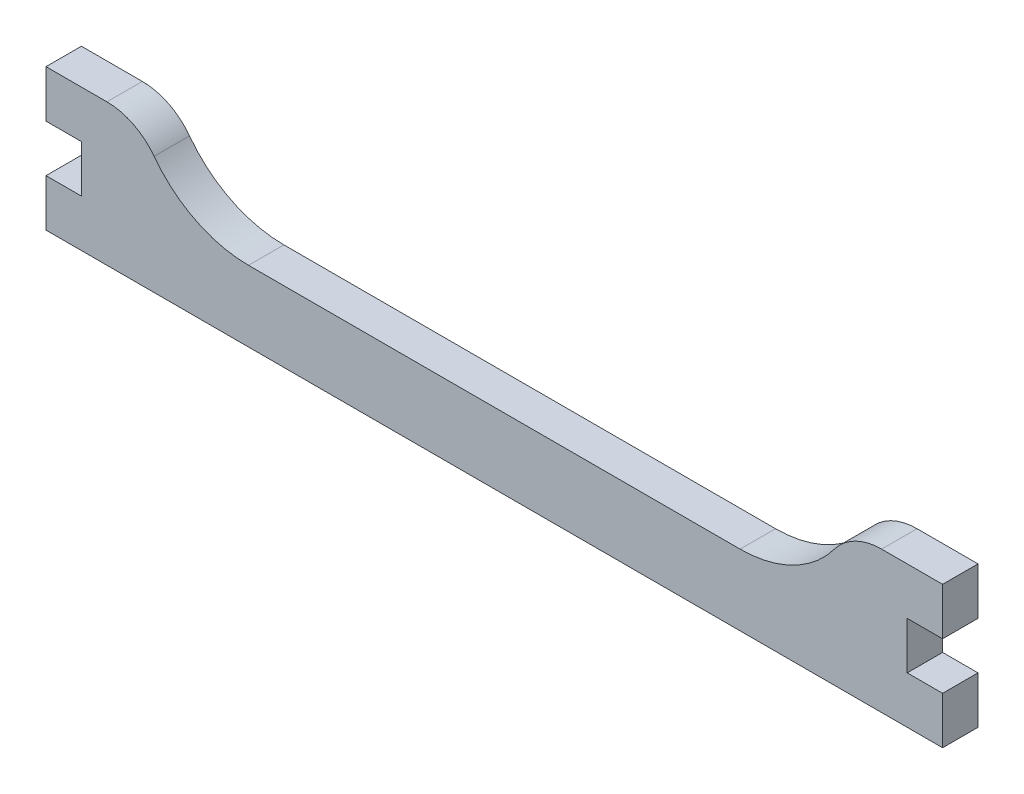
ISO-10303-21;
HEADER;
FILE_DESCRIPTION(('STEP AP214'),'2;1');
FILE_NAME('part.step','',(''),(''),'','','');
FILE_SCHEMA(('AUTOMOTIVE_DESIGN { 1 0 10303 214 1 1 1 1 }'));
ENDSEC;
DATA;
#1=APPLICATION_CONTEXT('core data for automotive mechanical design processes');
#2=APPLICATION_PROTOCOL_DEFINITION('international standard','automotive_design',2000,#1);
#3=PRODUCT_CONTEXT('',#1,'mechanical');
#4=PRODUCT('Part','Part','',(#3));
#5=PRODUCT_RELATED_PRODUCT_CATEGORY('part','',(#4));
#6=PRODUCT_DEFINITION_FORMATION('','',#4);
#7=PRODUCT_DEFINITION_CONTEXT('part definition',#1,'design');
#8=PRODUCT_DEFINITION('design','',#6,#7);
#9=PRODUCT_DEFINITION_SHAPE('','',#8);
#10=(LENGTH_UNIT() NAMED_UNIT(*) SI_UNIT(.MILLI.,.METRE.));
#11=(NAMED_UNIT(*) PLANE_ANGLE_UNIT() SI_UNIT($,.RADIAN.));
#12=(NAMED_UNIT(*) SI_UNIT($,.STERADIAN.) SOLID_ANGLE_UNIT());
#13=UNCERTAINTY_MEASURE_WITH_UNIT(LENGTH_MEASURE(1.E-05),#10,'distance_accuracy_value','');
#14=(GEOMETRIC_REPRESENTATION_CONTEXT(3) GLOBAL_UNCERTAINTY_ASSIGNED_CONTEXT((#13)) GLOBAL_UNIT_ASSIGNED_CONTEXT((#10,
#11,#12)) REPRESENTATION_CONTEXT('',''));
#15=CARTESIAN_POINT('',(0.,0.,0.));
#16=DIRECTION('',(0.,0.,1.));
#17=DIRECTION('',(1.,0.,0.));
#18=AXIS2_PLACEMENT_3D('',#15,#16,#17);
#19=CARTESIAN_POINT('',(-35.,12.,1.5));
#20=DIRECTION('',(0.,-1.,0.));
#21=DIRECTION('',(1.,0.,0.));
#22=AXIS2_PLACEMENT_3D('',#19,#20,#21);
#23=PLANE('',#22);
#24=DIRECTION('',(-1.,0.,0.));
#25=VECTOR('',#24,1.);
#26=CARTESIAN_POINT('',(-35.,12.,1.5));
#27=LINE('',#26,#25);
#28=CARTESIAN_POINT('',(-32.8348486100883,12.,1.5));
#29=VERTEX_POINT('',#28);
#30=CARTESIAN_POINT('',(-38.,12.,1.5));
#31=VERTEX_POINT('',#30);
#32=EDGE_CURVE('E238',#29,#31,#27,.T.);
#33=ORIENTED_EDGE('',*,*,#32,.F.);
#34=DIRECTION('',(0.,0.,1.));
#35=VECTOR('',#34,1.);
#36=CARTESIAN_POINT('',(-32.8348486100883,12.,1.5));
#37=LINE('',#36,#35);
#38=CARTESIAN_POINT('',(-32.8348486100883,12.,-1.5));
#39=VERTEX_POINT('',#38);
#40=EDGE_CURVE('E11',#29,#39,#37,.F.);
#41=ORIENTED_EDGE('',*,*,#40,.T.);
#42=DIRECTION('',(-1.,0.,0.));
#43=VECTOR('',#42,1.);
#44=CARTESIAN_POINT('',(-35.,12.,-1.5));
#45=LINE('',#44,#43);
#46=CARTESIAN_POINT('',(-38.,12.,-1.5));
#47=VERTEX_POINT('',#46);
#48=EDGE_CURVE('E159',#39,#47,#45,.T.);
#49=ORIENTED_EDGE('',*,*,#48,.T.);
#50=DIRECTION('',(0.,0.,1.));
#51=VECTOR('',#50,1.);
#52=CARTESIAN_POINT('',(-38.,12.,-1.5));
#53=LINE('',#52,#51);
#54=EDGE_CURVE('E162',#47,#31,#53,.T.);
#55=ORIENTED_EDGE('',*,*,#54,.T.);
#56=EDGE_LOOP('',(#33,#41,#49,#55));
#57=FACE_BOUND('',#56,.T.);
#58=ADVANCED_FACE('F32',(#57),#23,.F.);
#59=CARTESIAN_POINT('',(-35.,0.,1.5));
#60=DIRECTION('',(1.,0.,0.));
#61=DIRECTION('',(0.,0.,-1.));
#62=AXIS2_PLACEMENT_3D('',#59,#60,#61);
#63=PLANE('',#62);
#64=DIRECTION('',(0.,-1.,0.));
#65=VECTOR('',#64,1.);
#66=CARTESIAN_POINT('',(-35.,0.,1.5));
#67=LINE('',#66,#65);
#68=CARTESIAN_POINT('',(-35.,8.00000000000001,1.5));
#69=VERTEX_POINT('',#68);
#70=CARTESIAN_POINT('',(-35.,4.,1.5));
#71=VERTEX_POINT('',#70);
#72=EDGE_CURVE('E36',#69,#71,#67,.T.);
#73=ORIENTED_EDGE('',*,*,#72,.F.);
#74=DIRECTION('',(0.,0.,1.));
#75=VECTOR('',#74,1.);
#76=CARTESIAN_POINT('',(-35.,8.00000000000001,-1.5));
#77=LINE('',#76,#75);
#78=CARTESIAN_POINT('',(-35.,8.00000000000001,-1.5));
#79=VERTEX_POINT('',#78);
#80=EDGE_CURVE('E190',#79,#69,#77,.T.);
#81=ORIENTED_EDGE('',*,*,#80,.F.);
#82=DIRECTION('',(0.,-1.,0.));
#83=VECTOR('',#82,1.);
#84=CARTESIAN_POINT('',(-35.,0.,-1.5));
#85=LINE('',#84,#83);
#86=CARTESIAN_POINT('',(-35.,4.,-1.5));
#87=VERTEX_POINT('',#86);
#88=EDGE_CURVE('E220',#79,#87,#85,.T.);
#89=ORIENTED_EDGE('',*,*,#88,.T.);
#90=DIRECTION('',(0.,0.,1.));
#91=VECTOR('',#90,1.);
#92=CARTESIAN_POINT('',(-35.,4.,-1.5));
#93=LINE('',#92,#91);
#94=EDGE_CURVE('E197',#87,#71,#93,.T.);
#95=ORIENTED_EDGE('',*,*,#94,.T.);
#96=EDGE_LOOP('',(#73,#81,#89,#95));
#97=FACE_BOUND('',#96,.T.);
#98=ADVANCED_FACE('F366',(#97),#63,.F.);
#99=CARTESIAN_POINT('',(-35.,0.,1.5));
#100=DIRECTION('',(0.,1.,0.));
#101=DIRECTION('',(-1.,0.,0.));
#102=AXIS2_PLACEMENT_3D('',#99,#100,#101);
#103=PLANE('',#102);
#104=DIRECTION('',(1.,0.,0.));
#105=VECTOR('',#104,1.);
#106=CARTESIAN_POINT('',(-35.,0.,-1.5));
#107=LINE('',#106,#105);
#108=CARTESIAN_POINT('',(-38.,0.,-1.5));
#109=VERTEX_POINT('',#108);
#110=CARTESIAN_POINT('',(38.,0.,-1.5));
#111=VERTEX_POINT('',#110);
#112=EDGE_CURVE('E222',#109,#111,#107,.T.);
#113=ORIENTED_EDGE('',*,*,#112,.T.);
#114=DIRECTION('',(0.,0.,1.));
#115=VECTOR('',#114,1.);
#116=CARTESIAN_POINT('',(38.,0.,-1.5));
#117=LINE('',#116,#115);
#118=CARTESIAN_POINT('',(38.,0.,1.5));
#119=VERTEX_POINT('',#118);
#120=EDGE_CURVE('E300',#111,#119,#117,.T.);
#121=ORIENTED_EDGE('',*,*,#120,.T.);
#122=DIRECTION('',(1.,0.,0.));
#123=VECTOR('',#122,1.);
#124=CARTESIAN_POINT('',(-35.,0.,1.5));
#125=LINE('',#124,#123);
#126=CARTESIAN_POINT('',(-38.,0.,1.5));
#127=VERTEX_POINT('',#126);
#128=EDGE_CURVE('E239',#127,#119,#125,.T.);
#129=ORIENTED_EDGE('',*,*,#128,.F.);
#130=DIRECTION('',(0.,0.,1.));
#131=VECTOR('',#130,1.);
#132=CARTESIAN_POINT('',(-38.,0.,-1.5));
#133=LINE('',#132,#131);
#134=EDGE_CURVE('E202',#109,#127,#133,.T.);
#135=ORIENTED_EDGE('',*,*,#134,.F.);
#136=EDGE_LOOP('',(#113,#121,#129,#135));
#137=FACE_BOUND('',#136,.T.);
#138=ADVANCED_FACE('F371',(#137),#103,.F.);
#139=CARTESIAN_POINT('',(35.,0.,1.5));
#140=DIRECTION('',(-1.,0.,0.));
#141=DIRECTION('',(0.,0.,1.));
#142=AXIS2_PLACEMENT_3D('',#139,#140,#141);
#143=PLANE('',#142);
#144=DIRECTION('',(0.,1.,0.));
#145=VECTOR('',#144,1.);
#146=CARTESIAN_POINT('',(35.,0.,1.5));
#147=LINE('',#146,#145);
#148=CARTESIAN_POINT('',(35.,4.,1.5));
#149=VERTEX_POINT('',#148);
#150=CARTESIAN_POINT('',(35.,8.00000000000001,1.5));
#151=VERTEX_POINT('',#150);
#152=EDGE_CURVE('E237',#149,#151,#147,.T.);
#153=ORIENTED_EDGE('',*,*,#152,.F.);
#154=DIRECTION('',(0.,0.,1.));
#155=VECTOR('',#154,1.);
#156=CARTESIAN_POINT('',(35.,4.,-1.5));
#157=LINE('',#156,#155);
#158=CARTESIAN_POINT('',(35.,4.,-1.5));
#159=VERTEX_POINT('',#158);
#160=EDGE_CURVE('E275',#159,#149,#157,.T.);
#161=ORIENTED_EDGE('',*,*,#160,.F.);
#162=DIRECTION('',(0.,1.,0.));
#163=VECTOR('',#162,1.);
#164=CARTESIAN_POINT('',(35.,0.,-1.5));
#165=LINE('',#164,#163);
#166=CARTESIAN_POINT('',(35.,8.00000000000001,-1.5));
#167=VERTEX_POINT('',#166);
#168=EDGE_CURVE('E169',#159,#167,#165,.T.);
#169=ORIENTED_EDGE('',*,*,#168,.T.);
#170=DIRECTION('',(0.,0.,1.));
#171=VECTOR('',#170,1.);
#172=CARTESIAN_POINT('',(35.,8.00000000000001,-1.5));
#173=LINE('',#172,#171);
#174=EDGE_CURVE('E255',#167,#151,#173,.T.);
#175=ORIENTED_EDGE('',*,*,#174,.T.);
#176=EDGE_LOOP('',(#153,#161,#169,#175));
#177=FACE_BOUND('',#176,.T.);
#178=ADVANCED_FACE('F292',(#177),#143,.F.);
#179=CARTESIAN_POINT('',(38.,12.,-1.5));
#180=VERTEX_POINT('',#179);
#181=CARTESIAN_POINT('',(32.8348486100883,12.,-1.5));
#182=VERTEX_POINT('',#181);
#183=EDGE_CURVE('E168',#180,#182,#45,.T.);
#184=ORIENTED_EDGE('',*,*,#183,.T.);
#185=DIRECTION('',(0.,0.,-1.));
#186=VECTOR('',#185,1.);
#187=CARTESIAN_POINT('',(32.8348486100883,12.,1.5));
#188=LINE('',#187,#186);
#189=CARTESIAN_POINT('',(32.8348486100883,12.,1.5));
#190=VERTEX_POINT('',#189);
#191=EDGE_CURVE('E319',#182,#190,#188,.F.);
#192=ORIENTED_EDGE('',*,*,#191,.T.);
#193=CARTESIAN_POINT('',(38.,12.,1.5));
#194=VERTEX_POINT('',#193);
#195=EDGE_CURVE('E227',#194,#190,#27,.T.);
#196=ORIENTED_EDGE('',*,*,#195,.F.);
#197=DIRECTION('',(0.,0.,1.));
#198=VECTOR('',#197,1.);
#199=CARTESIAN_POINT('',(38.,12.,-1.5));
#200=LINE('',#199,#198);
#201=EDGE_CURVE('E247',#180,#194,#200,.T.);
#202=ORIENTED_EDGE('',*,*,#201,.F.);
#203=EDGE_LOOP('',(#184,#192,#196,#202));
#204=FACE_BOUND('',#203,.T.);
#205=ADVANCED_FACE('F318',(#204),#23,.F.);
#206=CARTESIAN_POINT('',(0.,0.,1.5));
#207=DIRECTION('',(0.,0.,-1.));
#208=DIRECTION('',(-1.,0.,0.));
#209=AXIS2_PLACEMENT_3D('',#206,#207,#208);
#210=PLANE('',#209);
#211=ORIENTED_EDGE('',*,*,#195,.T.);
#212=CARTESIAN_POINT('',(32.8348486100883,7.00000000000001,1.5));
#213=DIRECTION('',(0.,0.,-1.));
#214=DIRECTION('',(-1.,0.,0.));
#215=AXIS2_PLACEMENT_3D('',#212,#213,#214);
#216=CIRCLE('',#215,5.);
#217=CARTESIAN_POINT('',(28.8348486100883,10.,1.5));
#218=VERTEX_POINT('',#217);
#219=EDGE_CURVE('E333',#190,#218,#216,.F.);
#220=ORIENTED_EDGE('',*,*,#219,.T.);
#221=CARTESIAN_POINT('',(20.8348486100883,16.,1.5));
#222=DIRECTION('',(0.,0.,-1.));
#223=DIRECTION('',(-1.,0.,0.));
#224=AXIS2_PLACEMENT_3D('',#221,#222,#223);
#225=CIRCLE('',#224,10.);
#226=CARTESIAN_POINT('',(20.8348486100883,6.,1.5));
#227=VERTEX_POINT('',#226);
#228=EDGE_CURVE('E346',#218,#227,#225,.T.);
#229=ORIENTED_EDGE('',*,*,#228,.T.);
#230=DIRECTION('',(1.,0.,0.));
#231=VECTOR('',#230,1.);
#232=CARTESIAN_POINT('',(0.,6.,1.5));
#233=LINE('',#232,#231);
#234=CARTESIAN_POINT('',(-20.8348486100883,6.,1.5));
#235=VERTEX_POINT('',#234);
#236=EDGE_CURVE('E244',#235,#227,#233,.T.);
#237=ORIENTED_EDGE('',*,*,#236,.F.);
#238=CARTESIAN_POINT('',(-20.8348486100883,16.,1.5));
#239=DIRECTION('',(0.,0.,-1.));
#240=DIRECTION('',(-1.,0.,0.));
#241=AXIS2_PLACEMENT_3D('',#238,#239,#240);
#242=CIRCLE('',#241,10.);
#243=CARTESIAN_POINT('',(-28.8348486100883,10.,1.5));
#244=VERTEX_POINT('',#243);
#245=EDGE_CURVE('E340',#235,#244,#242,.T.);
#246=ORIENTED_EDGE('',*,*,#245,.T.);
#247=CARTESIAN_POINT('',(-32.8348486100883,7.,1.5));
#248=DIRECTION('',(0.,0.,-1.));
#249=DIRECTION('',(-1.,0.,0.));
#250=AXIS2_PLACEMENT_3D('',#247,#248,#249);
#251=CIRCLE('',#250,5.);
#252=EDGE_CURVE('E324',#244,#29,#251,.F.);
#253=ORIENTED_EDGE('',*,*,#252,.T.);
#254=ORIENTED_EDGE('',*,*,#32,.T.);
#255=DIRECTION('',(0.,-1.,0.));
#256=VECTOR('',#255,1.);
#257=CARTESIAN_POINT('',(-38.,12.,1.5));
#258=LINE('',#257,#256);
#259=CARTESIAN_POINT('',(-38.,8.00000000000001,1.5));
#260=VERTEX_POINT('',#259);
#261=EDGE_CURVE('E176',#31,#260,#258,.T.);
#262=ORIENTED_EDGE('',*,*,#261,.T.);
#263=DIRECTION('',(1.,0.,0.));
#264=VECTOR('',#263,1.);
#265=CARTESIAN_POINT('',(-35.,8.00000000000001,1.5));
#266=LINE('',#265,#264);
#267=EDGE_CURVE('E184',#260,#69,#266,.T.);
#268=ORIENTED_EDGE('',*,*,#267,.T.);
#269=ORIENTED_EDGE('',*,*,#72,.T.);
#270=DIRECTION('',(-1.,0.,0.));
#271=VECTOR('',#270,1.);
#272=CARTESIAN_POINT('',(-35.,4.,1.5));
#273=LINE('',#272,#271);
#274=CARTESIAN_POINT('',(-38.,4.,1.5));
#275=VERTEX_POINT('',#274);
#276=EDGE_CURVE('E192',#71,#275,#273,.T.);
#277=ORIENTED_EDGE('',*,*,#276,.T.);
#278=DIRECTION('',(0.,-1.,0.));
#279=VECTOR('',#278,1.);
#280=CARTESIAN_POINT('',(-38.,0.,1.5));
#281=LINE('',#280,#279);
#282=EDGE_CURVE('E199',#275,#127,#281,.T.);
#283=ORIENTED_EDGE('',*,*,#282,.T.);
#284=ORIENTED_EDGE('',*,*,#128,.T.);
#285=DIRECTION('',(0.,1.,0.));
#286=VECTOR('',#285,1.);
#287=CARTESIAN_POINT('',(38.,0.,1.5));
#288=LINE('',#287,#286);
#289=CARTESIAN_POINT('',(38.,4.,1.5));
#290=VERTEX_POINT('',#289);
#291=EDGE_CURVE('E205',#119,#290,#288,.T.);
#292=ORIENTED_EDGE('',*,*,#291,.T.);
#293=DIRECTION('',(-1.,0.,0.));
#294=VECTOR('',#293,1.);
#295=CARTESIAN_POINT('',(35.,4.,1.5));
#296=LINE('',#295,#294);
#297=EDGE_CURVE('E288',#290,#149,#296,.T.);
#298=ORIENTED_EDGE('',*,*,#297,.T.);
#299=ORIENTED_EDGE('',*,*,#152,.T.);
#300=DIRECTION('',(1.,0.,0.));
#301=VECTOR('',#300,1.);
#302=CARTESIAN_POINT('',(35.,8.00000000000001,1.5));
#303=LINE('',#302,#301);
#304=CARTESIAN_POINT('',(38.,8.00000000000001,1.5));
#305=VERTEX_POINT('',#304);
#306=EDGE_CURVE('E270',#151,#305,#303,.T.);
#307=ORIENTED_EDGE('',*,*,#306,.T.);
#308=DIRECTION('',(0.,1.,0.));
#309=VECTOR('',#308,1.);
#310=CARTESIAN_POINT('',(38.,12.,1.5));
#311=LINE('',#310,#309);
#312=EDGE_CURVE('E263',#305,#194,#311,.T.);
#313=ORIENTED_EDGE('',*,*,#312,.T.);
#314=EDGE_LOOP('',(#211,#220,#229,#237,#246,#253,#254,#262,#268,#269,#277,#283,#284,#292,#298,
#299,#307,#313));
#315=FACE_BOUND('',#314,.T.);
#316=ADVANCED_FACE('F284',(#315),#210,.F.);
#317=CARTESIAN_POINT('',(0.,0.,-1.5));
#318=DIRECTION('',(0.,0.,-1.));
#319=DIRECTION('',(-1.,0.,0.));
#320=AXIS2_PLACEMENT_3D('',#317,#318,#319);
#321=PLANE('',#320);
#322=CARTESIAN_POINT('',(20.8348486100883,16.,-1.5));
#323=DIRECTION('',(0.,0.,-1.));
#324=DIRECTION('',(-1.,0.,0.));
#325=AXIS2_PLACEMENT_3D('',#322,#323,#324);
#326=CIRCLE('',#325,10.);
#327=CARTESIAN_POINT('',(20.8348486100883,6.,-1.5));
#328=VERTEX_POINT('',#327);
#329=CARTESIAN_POINT('',(28.8348486100883,10.,-1.5));
#330=VERTEX_POINT('',#329);
#331=EDGE_CURVE('E343',#328,#330,#326,.F.);
#332=ORIENTED_EDGE('',*,*,#331,.T.);
#333=CARTESIAN_POINT('',(32.8348486100883,7.00000000000001,-1.5));
#334=DIRECTION('',(0.,0.,-1.));
#335=DIRECTION('',(-1.,0.,0.));
#336=AXIS2_PLACEMENT_3D('',#333,#334,#335);
#337=CIRCLE('',#336,5.);
#338=EDGE_CURVE('E314',#330,#182,#337,.T.);
#339=ORIENTED_EDGE('',*,*,#338,.T.);
#340=ORIENTED_EDGE('',*,*,#183,.F.);
#341=DIRECTION('',(0.,1.,0.));
#342=VECTOR('',#341,1.);
#343=CARTESIAN_POINT('',(38.,12.,-1.5));
#344=LINE('',#343,#342);
#345=CARTESIAN_POINT('',(38.,8.00000000000001,-1.5));
#346=VERTEX_POINT('',#345);
#347=EDGE_CURVE('E258',#346,#180,#344,.T.);
#348=ORIENTED_EDGE('',*,*,#347,.F.);
#349=DIRECTION('',(1.,0.,0.));
#350=VECTOR('',#349,1.);
#351=CARTESIAN_POINT('',(35.,8.00000000000001,-1.5));
#352=LINE('',#351,#350);
#353=EDGE_CURVE('E261',#167,#346,#352,.T.);
#354=ORIENTED_EDGE('',*,*,#353,.F.);
#355=ORIENTED_EDGE('',*,*,#168,.F.);
#356=DIRECTION('',(-1.,0.,0.));
#357=VECTOR('',#356,1.);
#358=CARTESIAN_POINT('',(35.,4.,-1.5));
#359=LINE('',#358,#357);
#360=CARTESIAN_POINT('',(38.,4.,-1.5));
#361=VERTEX_POINT('',#360);
#362=EDGE_CURVE('E297',#361,#159,#359,.T.);
#363=ORIENTED_EDGE('',*,*,#362,.F.);
#364=DIRECTION('',(0.,1.,0.));
#365=VECTOR('',#364,1.);
#366=CARTESIAN_POINT('',(38.,0.,-1.5));
#367=LINE('',#366,#365);
#368=EDGE_CURVE('E210',#111,#361,#367,.T.);
#369=ORIENTED_EDGE('',*,*,#368,.F.);
#370=ORIENTED_EDGE('',*,*,#112,.F.);
#371=DIRECTION('',(0.,-1.,0.));
#372=VECTOR('',#371,1.);
#373=CARTESIAN_POINT('',(-38.,0.,-1.5));
#374=LINE('',#373,#372);
#375=CARTESIAN_POINT('',(-38.,4.,-1.5));
#376=VERTEX_POINT('',#375);
#377=EDGE_CURVE('E194',#376,#109,#374,.T.);
#378=ORIENTED_EDGE('',*,*,#377,.F.);
#379=DIRECTION('',(-1.,0.,0.));
#380=VECTOR('',#379,1.);
#381=CARTESIAN_POINT('',(-35.,4.,-1.5));
#382=LINE('',#381,#380);
#383=EDGE_CURVE('E198',#87,#376,#382,.T.);
#384=ORIENTED_EDGE('',*,*,#383,.F.);
#385=ORIENTED_EDGE('',*,*,#88,.F.);
#386=DIRECTION('',(1.,0.,0.));
#387=VECTOR('',#386,1.);
#388=CARTESIAN_POINT('',(-35.,8.00000000000001,-1.5));
#389=LINE('',#388,#387);
#390=CARTESIAN_POINT('',(-38.,8.00000000000001,-1.5));
#391=VERTEX_POINT('',#390);
#392=EDGE_CURVE('E178',#391,#79,#389,.T.);
#393=ORIENTED_EDGE('',*,*,#392,.F.);
#394=DIRECTION('',(0.,-1.,0.));
#395=VECTOR('',#394,1.);
#396=CARTESIAN_POINT('',(-38.,12.,-1.5));
#397=LINE('',#396,#395);
#398=EDGE_CURVE('E174',#47,#391,#397,.T.);
#399=ORIENTED_EDGE('',*,*,#398,.F.);
#400=ORIENTED_EDGE('',*,*,#48,.F.);
#401=CARTESIAN_POINT('',(-32.8348486100883,7.,-1.5));
#402=DIRECTION('',(0.,0.,-1.));
#403=DIRECTION('',(-1.,0.,0.));
#404=AXIS2_PLACEMENT_3D('',#401,#402,#403);
#405=CIRCLE('',#404,5.);
#406=CARTESIAN_POINT('',(-28.8348486100883,10.,-1.5));
#407=VERTEX_POINT('',#406);
#408=EDGE_CURVE('E328',#39,#407,#405,.T.);
#409=ORIENTED_EDGE('',*,*,#408,.T.);
#410=CARTESIAN_POINT('',(-20.8348486100883,16.,-1.5));
#411=DIRECTION('',(0.,0.,-1.));
#412=DIRECTION('',(-1.,0.,0.));
#413=AXIS2_PLACEMENT_3D('',#410,#411,#412);
#414=CIRCLE('',#413,10.);
#415=CARTESIAN_POINT('',(-20.8348486100883,6.,-1.5));
#416=VERTEX_POINT('',#415);
#417=EDGE_CURVE('E341',#407,#416,#414,.F.);
#418=ORIENTED_EDGE('',*,*,#417,.T.);
#419=DIRECTION('',(1.,0.,0.));
#420=VECTOR('',#419,1.);
#421=CARTESIAN_POINT('',(0.,6.,-1.5));
#422=LINE('',#421,#420);
#423=EDGE_CURVE('E223',#416,#328,#422,.T.);
#424=ORIENTED_EDGE('',*,*,#423,.T.);
#425=EDGE_LOOP('',(#332,#339,#340,#348,#354,#355,#363,#369,#370,#378,#384,#385,#393,#399,#400,
#409,#418,#424));
#426=FACE_BOUND('',#425,.T.);
#427=ADVANCED_FACE('F182',(#426),#321,.T.);
#428=CARTESIAN_POINT('',(0.,6.,-1.5));
#429=DIRECTION('',(0.,-1.,0.));
#430=DIRECTION('',(0.,0.,-1.));
#431=AXIS2_PLACEMENT_3D('',#428,#429,#430);
#432=PLANE('',#431);
#433=ORIENTED_EDGE('',*,*,#236,.T.);
#434=DIRECTION('',(0.,0.,-1.));
#435=VECTOR('',#434,1.);
#436=CARTESIAN_POINT('',(20.8348486100883,6.,-1.5));
#437=LINE('',#436,#435);
#438=EDGE_CURVE('E322',#227,#328,#437,.T.);
#439=ORIENTED_EDGE('',*,*,#438,.T.);
#440=ORIENTED_EDGE('',*,*,#423,.F.);
#441=DIRECTION('',(0.,0.,1.));
#442=VECTOR('',#441,1.);
#443=CARTESIAN_POINT('',(-20.8348486100883,6.,-1.5));
#444=LINE('',#443,#442);
#445=EDGE_CURVE('E320',#416,#235,#444,.T.);
#446=ORIENTED_EDGE('',*,*,#445,.T.);
#447=EDGE_LOOP('',(#433,#439,#440,#446));
#448=FACE_BOUND('',#447,.T.);
#449=ADVANCED_FACE('F387',(#448),#432,.F.);
#450=CARTESIAN_POINT('',(20.8348486100883,16.,-1.5));
#451=DIRECTION('',(0.,0.,-1.));
#452=DIRECTION('',(-1.,0.,0.));
#453=AXIS2_PLACEMENT_3D('',#450,#451,#452);
#454=CYLINDRICAL_SURFACE('',#453,10.);
#455=ORIENTED_EDGE('',*,*,#228,.F.);
#456=DIRECTION('',(0.,0.,-1.));
#457=VECTOR('',#456,1.);
#458=CARTESIAN_POINT('',(28.8348486100883,10.,-1.5));
#459=LINE('',#458,#457);
#460=EDGE_CURVE('E330',#218,#330,#459,.T.);
#461=ORIENTED_EDGE('',*,*,#460,.T.);
#462=ORIENTED_EDGE('',*,*,#331,.F.);
#463=ORIENTED_EDGE('',*,*,#438,.F.);
#464=EDGE_LOOP('',(#455,#461,#462,#463));
#465=FACE_BOUND('',#464,.T.);
#466=ADVANCED_FACE('F356',(#465),#454,.F.);
#467=CARTESIAN_POINT('',(-20.8348486100883,16.,-1.5));
#468=DIRECTION('',(0.,0.,1.));
#469=DIRECTION('',(1.,0.,0.));
#470=AXIS2_PLACEMENT_3D('',#467,#468,#469);
#471=CYLINDRICAL_SURFACE('',#470,10.);
#472=ORIENTED_EDGE('',*,*,#417,.F.);
#473=DIRECTION('',(0.,0.,1.));
#474=VECTOR('',#473,1.);
#475=CARTESIAN_POINT('',(-28.8348486100883,10.,-1.5));
#476=LINE('',#475,#474);
#477=EDGE_CURVE('E42',#407,#244,#476,.T.);
#478=ORIENTED_EDGE('',*,*,#477,.T.);
#479=ORIENTED_EDGE('',*,*,#245,.F.);
#480=ORIENTED_EDGE('',*,*,#445,.F.);
#481=EDGE_LOOP('',(#472,#478,#479,#480));
#482=FACE_BOUND('',#481,.T.);
#483=ADVANCED_FACE('F338',(#482),#471,.F.);
#484=CARTESIAN_POINT('',(32.8348486100883,7.00000000000001,-1.5));
#485=DIRECTION('',(0.,0.,-1.));
#486=DIRECTION('',(-1.,0.,0.));
#487=AXIS2_PLACEMENT_3D('',#484,#485,#486);
#488=CYLINDRICAL_SURFACE('',#487,5.);
#489=ORIENTED_EDGE('',*,*,#338,.F.);
#490=ORIENTED_EDGE('',*,*,#460,.F.);
#491=ORIENTED_EDGE('',*,*,#219,.F.);
#492=ORIENTED_EDGE('',*,*,#191,.F.);
#493=EDGE_LOOP('',(#489,#490,#491,#492));
#494=FACE_BOUND('',#493,.T.);
#495=ADVANCED_FACE('F358',(#494),#488,.T.);
#496=CARTESIAN_POINT('',(-32.8348486100883,7.,-1.5));
#497=DIRECTION('',(0.,0.,1.));
#498=DIRECTION('',(1.,0.,0.));
#499=AXIS2_PLACEMENT_3D('',#496,#497,#498);
#500=CYLINDRICAL_SURFACE('',#499,5.);
#501=ORIENTED_EDGE('',*,*,#408,.F.);
#502=ORIENTED_EDGE('',*,*,#40,.F.);
#503=ORIENTED_EDGE('',*,*,#252,.F.);
#504=ORIENTED_EDGE('',*,*,#477,.F.);
#505=EDGE_LOOP('',(#501,#502,#503,#504));
#506=FACE_BOUND('',#505,.T.);
#507=ADVANCED_FACE('F34',(#506),#500,.T.);
#508=CARTESIAN_POINT('',(38.,12.,-1.5));
#509=DIRECTION('',(1.,0.,0.));
#510=DIRECTION('',(0.,0.,-1.));
#511=AXIS2_PLACEMENT_3D('',#508,#509,#510);
#512=PLANE('',#511);
#513=ORIENTED_EDGE('',*,*,#312,.F.);
#514=DIRECTION('',(0.,0.,1.));
#515=VECTOR('',#514,1.);
#516=CARTESIAN_POINT('',(38.,8.00000000000001,-1.5));
#517=LINE('',#516,#515);
#518=EDGE_CURVE('E252',#346,#305,#517,.T.);
#519=ORIENTED_EDGE('',*,*,#518,.F.);
#520=ORIENTED_EDGE('',*,*,#347,.T.);
#521=ORIENTED_EDGE('',*,*,#201,.T.);
#522=EDGE_LOOP('',(#513,#519,#520,#521));
#523=FACE_BOUND('',#522,.T.);
#524=ADVANCED_FACE('F283',(#523),#512,.T.);
#525=CARTESIAN_POINT('',(35.,8.00000000000001,-1.5));
#526=DIRECTION('',(0.,-1.,0.));
#527=DIRECTION('',(1.,0.,0.));
#528=AXIS2_PLACEMENT_3D('',#525,#526,#527);
#529=PLANE('',#528);
#530=ORIENTED_EDGE('',*,*,#306,.F.);
#531=ORIENTED_EDGE('',*,*,#174,.F.);
#532=ORIENTED_EDGE('',*,*,#353,.T.);
#533=ORIENTED_EDGE('',*,*,#518,.T.);
#534=EDGE_LOOP('',(#530,#531,#532,#533));
#535=FACE_BOUND('',#534,.T.);
#536=ADVANCED_FACE('F281',(#535),#529,.T.);
#537=CARTESIAN_POINT('',(35.,4.,-1.5));
#538=DIRECTION('',(0.,1.,0.));
#539=DIRECTION('',(0.,0.,1.));
#540=AXIS2_PLACEMENT_3D('',#537,#538,#539);
#541=PLANE('',#540);
#542=ORIENTED_EDGE('',*,*,#297,.F.);
#543=DIRECTION('',(0.,0.,1.));
#544=VECTOR('',#543,1.);
#545=CARTESIAN_POINT('',(38.,4.,-1.5));
#546=LINE('',#545,#544);
#547=EDGE_CURVE('E298',#361,#290,#546,.T.);
#548=ORIENTED_EDGE('',*,*,#547,.F.);
#549=ORIENTED_EDGE('',*,*,#362,.T.);
#550=ORIENTED_EDGE('',*,*,#160,.T.);
#551=EDGE_LOOP('',(#542,#548,#549,#550));
#552=FACE_BOUND('',#551,.T.);
#553=ADVANCED_FACE('F295',(#552),#541,.T.);
#554=CARTESIAN_POINT('',(38.,0.,-1.5));
#555=DIRECTION('',(1.,0.,0.));
#556=DIRECTION('',(0.,0.,-1.));
#557=AXIS2_PLACEMENT_3D('',#554,#555,#556);
#558=PLANE('',#557);
#559=ORIENTED_EDGE('',*,*,#291,.F.);
#560=ORIENTED_EDGE('',*,*,#120,.F.);
#561=ORIENTED_EDGE('',*,*,#368,.T.);
#562=ORIENTED_EDGE('',*,*,#547,.T.);
#563=EDGE_LOOP('',(#559,#560,#561,#562));
#564=FACE_BOUND('',#563,.T.);
#565=ADVANCED_FACE('F310',(#564),#558,.T.);
#566=CARTESIAN_POINT('',(-38.,0.,-1.5));
#567=DIRECTION('',(-1.,0.,0.));
#568=DIRECTION('',(0.,0.,1.));
#569=AXIS2_PLACEMENT_3D('',#566,#567,#568);
#570=PLANE('',#569);
#571=ORIENTED_EDGE('',*,*,#282,.F.);
#572=DIRECTION('',(0.,0.,1.));
#573=VECTOR('',#572,1.);
#574=CARTESIAN_POINT('',(-38.,4.,-1.5));
#575=LINE('',#574,#573);
#576=EDGE_CURVE('E206',#376,#275,#575,.T.);
#577=ORIENTED_EDGE('',*,*,#576,.F.);
#578=ORIENTED_EDGE('',*,*,#377,.T.);
#579=ORIENTED_EDGE('',*,*,#134,.T.);
#580=EDGE_LOOP('',(#571,#577,#578,#579));
#581=FACE_BOUND('',#580,.T.);
#582=ADVANCED_FACE('F403',(#581),#570,.T.);
#583=CARTESIAN_POINT('',(-35.,4.,-1.5));
#584=DIRECTION('',(0.,1.,0.));
#585=DIRECTION('',(0.,0.,1.));
#586=AXIS2_PLACEMENT_3D('',#583,#584,#585);
#587=PLANE('',#586);
#588=ORIENTED_EDGE('',*,*,#276,.F.);
#589=ORIENTED_EDGE('',*,*,#94,.F.);
#590=ORIENTED_EDGE('',*,*,#383,.T.);
#591=ORIENTED_EDGE('',*,*,#576,.T.);
#592=EDGE_LOOP('',(#588,#589,#590,#591));
#593=FACE_BOUND('',#592,.T.);
#594=ADVANCED_FACE('F406',(#593),#587,.T.);
#595=CARTESIAN_POINT('',(-35.,8.00000000000001,-1.5));
#596=DIRECTION('',(0.,-1.,0.));
#597=DIRECTION('',(1.,0.,0.));
#598=AXIS2_PLACEMENT_3D('',#595,#596,#597);
#599=PLANE('',#598);
#600=ORIENTED_EDGE('',*,*,#267,.F.);
#601=DIRECTION('',(0.,0.,1.));
#602=VECTOR('',#601,1.);
#603=CARTESIAN_POINT('',(-38.,8.00000000000001,-1.5));
#604=LINE('',#603,#602);
#605=EDGE_CURVE('E177',#391,#260,#604,.T.);
#606=ORIENTED_EDGE('',*,*,#605,.F.);
#607=ORIENTED_EDGE('',*,*,#392,.T.);
#608=ORIENTED_EDGE('',*,*,#80,.T.);
#609=EDGE_LOOP('',(#600,#606,#607,#608));
#610=FACE_BOUND('',#609,.T.);
#611=ADVANCED_FACE('F409',(#610),#599,.T.);
#612=CARTESIAN_POINT('',(-38.,12.,-1.5));
#613=DIRECTION('',(-1.,0.,0.));
#614=DIRECTION('',(0.,0.,1.));
#615=AXIS2_PLACEMENT_3D('',#612,#613,#614);
#616=PLANE('',#615);
#617=ORIENTED_EDGE('',*,*,#261,.F.);
#618=ORIENTED_EDGE('',*,*,#54,.F.);
#619=ORIENTED_EDGE('',*,*,#398,.T.);
#620=ORIENTED_EDGE('',*,*,#605,.T.);
#621=EDGE_LOOP('',(#617,#618,#619,#620));
#622=FACE_BOUND('',#621,.T.);
#623=ADVANCED_FACE('F173',(#622),#616,.T.);
#624=CLOSED_SHELL('',(#58,#98,#138,#178,#205,#316,#427,#449,#466,#483,#495,#507,#524,#536,#553,
#565,#582,#594,#611,#623));
#625=MANIFOLD_SOLID_BREP('B2',#624);
#626=ADVANCED_BREP_SHAPE_REPRESENTATION('',(#18,#625),#14);
#627=SHAPE_DEFINITION_REPRESENTATION(#9,#626);
ENDSEC;
END-ISO-10303-21;
